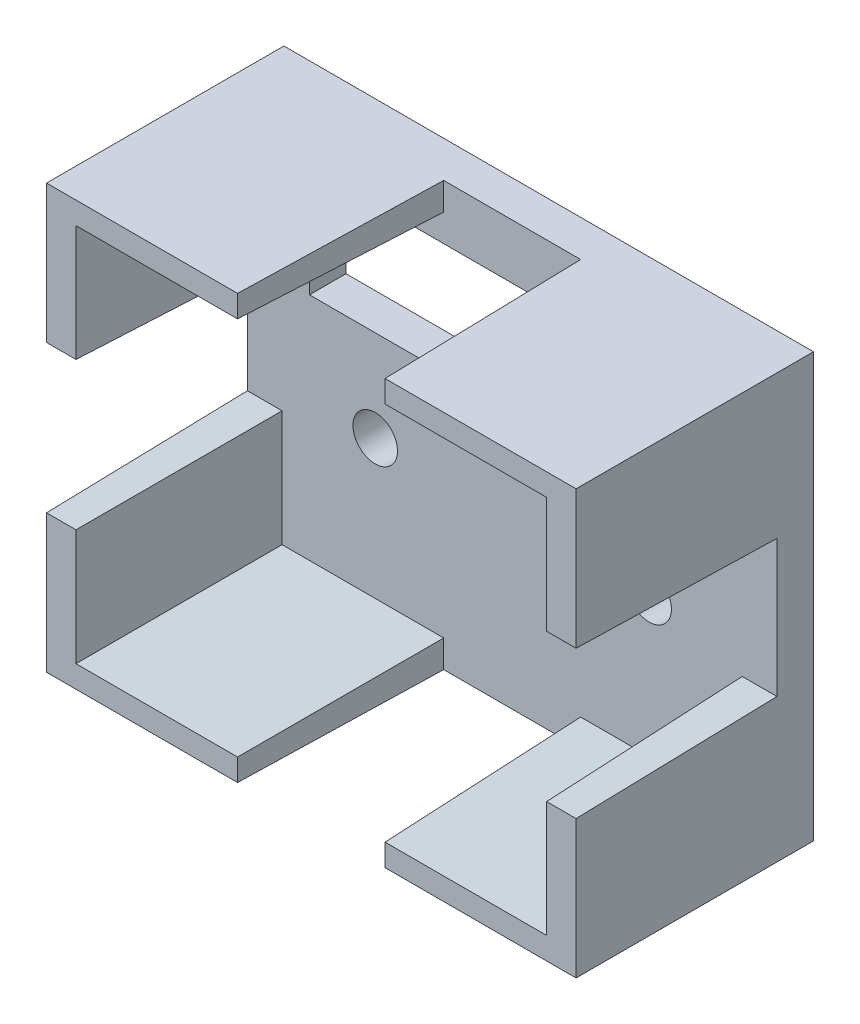
ISO-10303-21;
HEADER;
FILE_DESCRIPTION(('STEP AP214'),'2;1');
FILE_NAME('part.step','',(''),(''),'','','');
FILE_SCHEMA(('AUTOMOTIVE_DESIGN { 1 0 10303 214 1 1 1 1 }'));
ENDSEC;
DATA;
#1=APPLICATION_CONTEXT('core data for automotive mechanical design processes');
#2=APPLICATION_PROTOCOL_DEFINITION('international standard','automotive_design',2000,#1);
#3=PRODUCT_CONTEXT('',#1,'mechanical');
#4=PRODUCT('Part','Part','',(#3));
#5=PRODUCT_RELATED_PRODUCT_CATEGORY('part','',(#4));
#6=PRODUCT_DEFINITION_FORMATION('','',#4);
#7=PRODUCT_DEFINITION_CONTEXT('part definition',#1,'design');
#8=PRODUCT_DEFINITION('design','',#6,#7);
#9=PRODUCT_DEFINITION_SHAPE('','',#8);
#10=(LENGTH_UNIT() NAMED_UNIT(*) SI_UNIT(.MILLI.,.METRE.));
#11=(NAMED_UNIT(*) PLANE_ANGLE_UNIT() SI_UNIT($,.RADIAN.));
#12=(NAMED_UNIT(*) SI_UNIT($,.STERADIAN.) SOLID_ANGLE_UNIT());
#13=UNCERTAINTY_MEASURE_WITH_UNIT(LENGTH_MEASURE(1.E-05),#10,'distance_accuracy_value','');
#14=(GEOMETRIC_REPRESENTATION_CONTEXT(3) GLOBAL_UNCERTAINTY_ASSIGNED_CONTEXT((#13)) GLOBAL_UNIT_ASSIGNED_CONTEXT((#10,
#11,#12)) REPRESENTATION_CONTEXT('',''));
#15=CARTESIAN_POINT('',(0.,0.,0.));
#16=DIRECTION('',(0.,0.,1.));
#17=DIRECTION('',(1.,0.,0.));
#18=AXIS2_PLACEMENT_3D('',#15,#16,#17);
#19=CARTESIAN_POINT('',(0.,10.922,16.51));
#20=DIRECTION('',(0.,1.,0.));
#21=DIRECTION('',(0.,0.,1.));
#22=AXIS2_PLACEMENT_3D('',#19,#20,#21);
#23=PLANE('',#22);
#24=DIRECTION('',(1.,0.,0.));
#25=VECTOR('',#24,1.);
#26=CARTESIAN_POINT('',(400000.,10.9219999999937,2.54));
#27=LINE('',#26,#25);
#28=CARTESIAN_POINT('',(-14.0969999999925,10.9219999999937,2.54));
#29=VERTEX_POINT('',#28);
#30=CARTESIAN_POINT('',(14.0969999999925,10.9219999999937,2.54));
#31=VERTEX_POINT('',#30);
#32=EDGE_CURVE('E425',#29,#31,#27,.T.);
#33=ORIENTED_EDGE('',*,*,#32,.F.);
#34=DIRECTION('',(0.,0.,-1.));
#35=VECTOR('',#34,1.);
#36=CARTESIAN_POINT('',(-14.097,10.922,16.51));
#37=LINE('',#36,#35);
#38=CARTESIAN_POINT('',(-14.097,10.922,0.));
#39=VERTEX_POINT('',#38);
#40=EDGE_CURVE('E452',#29,#39,#37,.T.);
#41=ORIENTED_EDGE('',*,*,#40,.T.);
#42=DIRECTION('',(1.,0.,0.));
#43=VECTOR('',#42,1.);
#44=CARTESIAN_POINT('',(0.,10.922,0.));
#45=LINE('',#44,#43);
#46=CARTESIAN_POINT('',(14.097,10.922,0.));
#47=VERTEX_POINT('',#46);
#48=EDGE_CURVE('E532',#39,#47,#45,.T.);
#49=ORIENTED_EDGE('',*,*,#48,.T.);
#50=DIRECTION('',(0.,0.,-1.));
#51=VECTOR('',#50,1.);
#52=CARTESIAN_POINT('',(14.097,10.922,16.51));
#53=LINE('',#52,#51);
#54=EDGE_CURVE('E446',#31,#47,#53,.T.);
#55=ORIENTED_EDGE('',*,*,#54,.F.);
#56=EDGE_LOOP('',(#33,#41,#49,#55));
#57=FACE_BOUND('',#56,.T.);
#58=ADVANCED_FACE('F239',(#57),#23,.F.);
#59=CARTESIAN_POINT('',(14.097,0.,16.51));
#60=DIRECTION('',(1.,0.,0.));
#61=DIRECTION('',(0.,0.,-1.));
#62=AXIS2_PLACEMENT_3D('',#59,#60,#61);
#63=PLANE('',#62);
#64=DIRECTION('',(0.,-1.,0.));
#65=VECTOR('',#64,1.);
#66=CARTESIAN_POINT('',(14.0969999999925,-291583.236,2.54));
#67=LINE('',#66,#65);
#68=CARTESIAN_POINT('',(14.0969999999925,3.17499999999882,2.54));
#69=VERTEX_POINT('',#68);
#70=EDGE_CURVE('E422',#31,#69,#67,.T.);
#71=ORIENTED_EDGE('',*,*,#70,.F.);
#72=ORIENTED_EDGE('',*,*,#54,.T.);
#73=DIRECTION('',(0.,-1.,0.));
#74=VECTOR('',#73,1.);
#75=CARTESIAN_POINT('',(14.097,0.,0.));
#76=LINE('',#75,#74);
#77=CARTESIAN_POINT('',(14.097,3.17500000000001,0.));
#78=VERTEX_POINT('',#77);
#79=EDGE_CURVE('E443',#47,#78,#76,.T.);
#80=ORIENTED_EDGE('',*,*,#79,.T.);
#81=DIRECTION('',(0.,0.,-1.));
#82=VECTOR('',#81,1.);
#83=CARTESIAN_POINT('',(14.097,3.17500000000001,16.51));
#84=LINE('',#83,#82);
#85=EDGE_CURVE('E435',#69,#78,#84,.T.);
#86=ORIENTED_EDGE('',*,*,#85,.F.);
#87=EDGE_LOOP('',(#71,#72,#80,#86));
#88=FACE_BOUND('',#87,.T.);
#89=ADVANCED_FACE('F441',(#88),#63,.F.);
#90=CARTESIAN_POINT('',(-18.415,0.,16.51));
#91=DIRECTION('',(1.,0.,0.));
#92=DIRECTION('',(0.,0.,-1.));
#93=AXIS2_PLACEMENT_3D('',#90,#91,#92);
#94=PLANE('',#93);
#95=DIRECTION('',(0.,0.0261769483078732,0.999657324975557));
#96=VECTOR('',#95,1.);
#97=CARTESIAN_POINT('',(-18.415,5.12480323401792,16.3758023044565));
#98=LINE('',#97,#96);
#99=CARTESIAN_POINT('',(-18.4150000000045,5.12831732434819,16.51));
#100=VERTEX_POINT('',#99);
#101=CARTESIAN_POINT('',(-18.4150000000045,4.76250000002665,2.54));
#102=VERTEX_POINT('',#101);
#103=EDGE_CURVE('E741',#100,#102,#98,.F.);
#104=ORIENTED_EDGE('',*,*,#103,.F.);
#105=DIRECTION('',(0.,-1.,0.));
#106=VECTOR('',#105,1.);
#107=CARTESIAN_POINT('',(-18.415,0.,16.51));
#108=LINE('',#107,#106);
#109=CARTESIAN_POINT('',(-18.415,14.732,16.51));
#110=VERTEX_POINT('',#109);
#111=EDGE_CURVE('E495',#110,#100,#108,.T.);
#112=ORIENTED_EDGE('',*,*,#111,.F.);
#113=DIRECTION('',(0.,0.,-1.));
#114=VECTOR('',#113,1.);
#115=CARTESIAN_POINT('',(-18.415,14.732,16.51));
#116=LINE('',#115,#114);
#117=CARTESIAN_POINT('',(-18.415,14.732,0.));
#118=VERTEX_POINT('',#117);
#119=EDGE_CURVE('E467',#110,#118,#116,.T.);
#120=ORIENTED_EDGE('',*,*,#119,.T.);
#121=DIRECTION('',(0.,-1.,0.));
#122=VECTOR('',#121,1.);
#123=CARTESIAN_POINT('',(-18.415,0.,0.));
#124=LINE('',#123,#122);
#125=CARTESIAN_POINT('',(-18.415,-14.732,0.));
#126=VERTEX_POINT('',#125);
#127=EDGE_CURVE('E513',#118,#126,#124,.T.);
#128=ORIENTED_EDGE('',*,*,#127,.T.);
#129=DIRECTION('',(0.,0.,-1.));
#130=VECTOR('',#129,1.);
#131=CARTESIAN_POINT('',(-18.415,-14.732,16.51));
#132=LINE('',#131,#130);
#133=CARTESIAN_POINT('',(-18.415,-14.732,16.51));
#134=VERTEX_POINT('',#133);
#135=EDGE_CURVE('E463',#134,#126,#132,.T.);
#136=ORIENTED_EDGE('',*,*,#135,.F.);
#137=CARTESIAN_POINT('',(-18.4150000000045,-5.12831732434819,16.51));
#138=VERTEX_POINT('',#137);
#139=EDGE_CURVE('E502',#138,#134,#108,.T.);
#140=ORIENTED_EDGE('',*,*,#139,.F.);
#141=DIRECTION('',(0.,0.0261769483078732,-0.999657324975557));
#142=VECTOR('',#141,1.);
#143=CARTESIAN_POINT('',(-18.415,-5.12480323401792,16.3758023044565));
#144=LINE('',#143,#142);
#145=CARTESIAN_POINT('',(-18.4150000000045,-4.76250000002665,2.54));
#146=VERTEX_POINT('',#145);
#147=EDGE_CURVE('E737',#138,#146,#144,.T.);
#148=ORIENTED_EDGE('',*,*,#147,.T.);
#149=DIRECTION('',(0.,-1.,0.));
#150=VECTOR('',#149,1.);
#151=CARTESIAN_POINT('',(-18.4150000000045,-291583.236,2.54));
#152=LINE('',#151,#150);
#153=EDGE_CURVE('E622',#102,#146,#152,.T.);
#154=ORIENTED_EDGE('',*,*,#153,.F.);
#155=EDGE_LOOP('',(#104,#112,#120,#128,#136,#140,#148,#154));
#156=FACE_BOUND('',#155,.T.);
#157=ADVANCED_FACE('F800',(#156),#94,.F.);
#158=CARTESIAN_POINT('',(-9.525,-3.17499999999999,16.51));
#159=DIRECTION('',(0.,0.,-1.));
#160=DIRECTION('',(-1.,0.,0.));
#161=AXIS2_PLACEMENT_3D('',#158,#159,#160);
#162=CYLINDRICAL_SURFACE('',#161,1.55);
#163=CARTESIAN_POINT('',(-9.525,-3.17499999999999,0.));
#164=DIRECTION('',(0.,0.,1.));
#165=DIRECTION('',(1.,0.,0.));
#166=AXIS2_PLACEMENT_3D('',#163,#164,#165);
#167=CIRCLE('',#166,1.55);
#168=CARTESIAN_POINT('',(-7.975,-3.17499999999999,0.));
#169=VERTEX_POINT('',#168);
#170=EDGE_CURVE('E528',#169,#169,#167,.T.);
#171=ORIENTED_EDGE('',*,*,#170,.F.);
#172=EDGE_LOOP('',(#171));
#173=FACE_BOUND('',#172,.T.);
#174=CARTESIAN_POINT('',(-9.525,-3.17499999999999,2.54));
#175=DIRECTION('',(0.,0.,-1.));
#176=DIRECTION('',(-1.,0.,0.));
#177=AXIS2_PLACEMENT_3D('',#174,#175,#176);
#178=CIRCLE('',#177,1.55);
#179=CARTESIAN_POINT('',(-11.075,-3.17499999999999,2.54));
#180=VERTEX_POINT('',#179);
#181=EDGE_CURVE('E555',#180,#180,#178,.T.);
#182=ORIENTED_EDGE('',*,*,#181,.F.);
#183=EDGE_LOOP('',(#182));
#184=FACE_BOUND('',#183,.T.);
#185=ADVANCED_FACE('F833',(#173,#184),#162,.F.);
#186=CARTESIAN_POINT('',(9.525,-3.17499999999999,16.51));
#187=DIRECTION('',(0.,0.,-1.));
#188=DIRECTION('',(-1.,0.,0.));
#189=AXIS2_PLACEMENT_3D('',#186,#187,#188);
#190=CYLINDRICAL_SURFACE('',#189,1.55);
#191=CARTESIAN_POINT('',(9.525,-3.17499999999999,0.));
#192=DIRECTION('',(0.,0.,1.));
#193=DIRECTION('',(1.,0.,0.));
#194=AXIS2_PLACEMENT_3D('',#191,#192,#193);
#195=CIRCLE('',#194,1.55);
#196=CARTESIAN_POINT('',(11.075,-3.17499999999999,0.));
#197=VERTEX_POINT('',#196);
#198=EDGE_CURVE('E524',#197,#197,#195,.T.);
#199=ORIENTED_EDGE('',*,*,#198,.F.);
#200=EDGE_LOOP('',(#199));
#201=FACE_BOUND('',#200,.T.);
#202=CARTESIAN_POINT('',(9.525,-3.17499999999999,2.54));
#203=DIRECTION('',(0.,0.,-1.));
#204=DIRECTION('',(-1.,0.,0.));
#205=AXIS2_PLACEMENT_3D('',#202,#203,#204);
#206=CIRCLE('',#205,1.55);
#207=CARTESIAN_POINT('',(7.975,-3.17499999999999,2.54));
#208=VERTEX_POINT('',#207);
#209=EDGE_CURVE('E559',#208,#208,#206,.T.);
#210=ORIENTED_EDGE('',*,*,#209,.F.);
#211=EDGE_LOOP('',(#210));
#212=FACE_BOUND('',#211,.T.);
#213=ADVANCED_FACE('F836',(#201,#212),#190,.F.);
#214=CARTESIAN_POINT('',(18.415,0.,16.51));
#215=DIRECTION('',(1.,0.,0.));
#216=DIRECTION('',(0.,0.,-1.));
#217=AXIS2_PLACEMENT_3D('',#214,#215,#216);
#218=PLANE('',#217);
#219=DIRECTION('',(0.,-1.,0.));
#220=VECTOR('',#219,1.);
#221=CARTESIAN_POINT('',(18.4150000000045,-291583.236,2.54));
#222=LINE('',#221,#220);
#223=CARTESIAN_POINT('',(18.4150000000045,4.76250000002665,2.54));
#224=VERTEX_POINT('',#223);
#225=CARTESIAN_POINT('',(18.4150000000045,-4.76250000002665,2.54));
#226=VERTEX_POINT('',#225);
#227=EDGE_CURVE('E585',#224,#226,#222,.T.);
#228=ORIENTED_EDGE('',*,*,#227,.T.);
#229=DIRECTION('',(0.,0.0261769483078732,-0.999657324975557));
#230=VECTOR('',#229,1.);
#231=CARTESIAN_POINT('',(18.415,-5.12480323401792,16.3758023044565));
#232=LINE('',#231,#230);
#233=CARTESIAN_POINT('',(18.4150000000045,-5.12831732434819,16.51));
#234=VERTEX_POINT('',#233);
#235=EDGE_CURVE('E727',#226,#234,#232,.F.);
#236=ORIENTED_EDGE('',*,*,#235,.T.);
#237=DIRECTION('',(0.,-1.,0.));
#238=VECTOR('',#237,1.);
#239=CARTESIAN_POINT('',(18.415,0.,16.51));
#240=LINE('',#239,#238);
#241=CARTESIAN_POINT('',(18.415,-14.732,16.51));
#242=VERTEX_POINT('',#241);
#243=EDGE_CURVE('E500',#234,#242,#240,.T.);
#244=ORIENTED_EDGE('',*,*,#243,.T.);
#245=DIRECTION('',(0.,0.,-1.));
#246=VECTOR('',#245,1.);
#247=CARTESIAN_POINT('',(18.415,-14.732,16.51));
#248=LINE('',#247,#246);
#249=CARTESIAN_POINT('',(18.415,-14.732,0.));
#250=VERTEX_POINT('',#249);
#251=EDGE_CURVE('E459',#242,#250,#248,.T.);
#252=ORIENTED_EDGE('',*,*,#251,.T.);
#253=DIRECTION('',(0.,-1.,0.));
#254=VECTOR('',#253,1.);
#255=CARTESIAN_POINT('',(18.415,0.,0.));
#256=LINE('',#255,#254);
#257=CARTESIAN_POINT('',(18.415,14.732,0.));
#258=VERTEX_POINT('',#257);
#259=EDGE_CURVE('E520',#258,#250,#256,.T.);
#260=ORIENTED_EDGE('',*,*,#259,.F.);
#261=DIRECTION('',(0.,0.,-1.));
#262=VECTOR('',#261,1.);
#263=CARTESIAN_POINT('',(18.415,14.732,16.51));
#264=LINE('',#263,#262);
#265=CARTESIAN_POINT('',(18.415,14.732,16.51));
#266=VERTEX_POINT('',#265);
#267=EDGE_CURVE('E456',#266,#258,#264,.T.);
#268=ORIENTED_EDGE('',*,*,#267,.F.);
#269=CARTESIAN_POINT('',(18.4150000000045,5.12831732434819,16.51));
#270=VERTEX_POINT('',#269);
#271=EDGE_CURVE('E460',#266,#270,#240,.T.);
#272=ORIENTED_EDGE('',*,*,#271,.T.);
#273=DIRECTION('',(0.,0.0261769483078732,0.999657324975557));
#274=VECTOR('',#273,1.);
#275=CARTESIAN_POINT('',(18.415,5.12480323401792,16.3758023044565));
#276=LINE('',#275,#274);
#277=EDGE_CURVE('E723',#270,#224,#276,.F.);
#278=ORIENTED_EDGE('',*,*,#277,.T.);
#279=EDGE_LOOP('',(#228,#236,#244,#252,#260,#268,#272,#278));
#280=FACE_BOUND('',#279,.T.);
#281=ADVANCED_FACE('F761',(#280),#218,.T.);
#282=CARTESIAN_POINT('',(0.,0.,16.51));
#283=DIRECTION('',(0.,0.,1.));
#284=DIRECTION('',(1.,0.,0.));
#285=AXIS2_PLACEMENT_3D('',#282,#283,#284);
#286=PLANE('',#285);
#287=DIRECTION('',(0.,1.,0.));
#288=VECTOR('',#287,1.);
#289=CARTESIAN_POINT('',(-5.12831732434819,-291583.236,16.51));
#290=LINE('',#289,#288);
#291=CARTESIAN_POINT('',(-5.12831732434819,13.1928173243372,16.51));
#292=VERTEX_POINT('',#291);
#293=CARTESIAN_POINT('',(-5.12831732434819,14.7319999999809,16.51));
#294=VERTEX_POINT('',#293);
#295=EDGE_CURVE('E645',#292,#294,#290,.T.);
#296=ORIENTED_EDGE('',*,*,#295,.T.);
#297=DIRECTION('',(1.,0.,0.));
#298=VECTOR('',#297,1.);
#299=CARTESIAN_POINT('',(0.,14.732,16.51));
#300=LINE('',#299,#298);
#301=EDGE_CURVE('E745',#110,#294,#300,.T.);
#302=ORIENTED_EDGE('',*,*,#301,.F.);
#303=ORIENTED_EDGE('',*,*,#111,.T.);
#304=DIRECTION('',(1.,0.,0.));
#305=VECTOR('',#304,1.);
#306=CARTESIAN_POINT('',(400000.,5.12831732434819,16.51));
#307=LINE('',#306,#305);
#308=CARTESIAN_POINT('',(-16.367817324336,5.12831732434819,16.51));
#309=VERTEX_POINT('',#308);
#310=EDGE_CURVE('E691',#309,#100,#307,.F.);
#311=ORIENTED_EDGE('',*,*,#310,.F.);
#312=DIRECTION('',(0.,1.,0.));
#313=VECTOR('',#312,1.);
#314=CARTESIAN_POINT('',(-16.367817324336,-291583.236,16.51));
#315=LINE('',#314,#313);
#316=CARTESIAN_POINT('',(-16.367817324336,13.1928173243372,16.51));
#317=VERTEX_POINT('',#316);
#318=EDGE_CURVE('E688',#317,#309,#315,.F.);
#319=ORIENTED_EDGE('',*,*,#318,.F.);
#320=DIRECTION('',(1.,0.,0.));
#321=VECTOR('',#320,1.);
#322=CARTESIAN_POINT('',(400000.,13.1928173243372,16.51));
#323=LINE('',#322,#321);
#324=EDGE_CURVE('E684',#317,#292,#323,.T.);
#325=ORIENTED_EDGE('',*,*,#324,.T.);
#326=EDGE_LOOP('',(#296,#302,#303,#311,#319,#325));
#327=FACE_BOUND('',#326,.T.);
#328=ADVANCED_FACE('F782',(#327),#286,.T.);
#329=DIRECTION('',(-1.,0.,0.));
#330=VECTOR('',#329,1.);
#331=CARTESIAN_POINT('',(400000.,-13.1928173243372,16.51));
#332=LINE('',#331,#330);
#333=CARTESIAN_POINT('',(5.12831732434819,-13.1928173243372,16.51));
#334=VERTEX_POINT('',#333);
#335=CARTESIAN_POINT('',(16.367817324336,-13.1928173243372,16.51));
#336=VERTEX_POINT('',#335);
#337=EDGE_CURVE('E483',#334,#336,#332,.F.);
#338=ORIENTED_EDGE('',*,*,#337,.F.);
#339=DIRECTION('',(0.,1.,0.));
#340=VECTOR('',#339,1.);
#341=CARTESIAN_POINT('',(5.12831732434819,0.,16.51));
#342=LINE('',#341,#340);
#343=CARTESIAN_POINT('',(5.12831732434819,-14.7319999999809,16.51));
#344=VERTEX_POINT('',#343);
#345=EDGE_CURVE('E248',#334,#344,#342,.F.);
#346=ORIENTED_EDGE('',*,*,#345,.T.);
#347=DIRECTION('',(1.,0.,0.));
#348=VECTOR('',#347,1.);
#349=CARTESIAN_POINT('',(0.,-14.732,16.51));
#350=LINE('',#349,#348);
#351=EDGE_CURVE('E480',#344,#242,#350,.T.);
#352=ORIENTED_EDGE('',*,*,#351,.T.);
#353=ORIENTED_EDGE('',*,*,#243,.F.);
#354=DIRECTION('',(-1.,0.,0.));
#355=VECTOR('',#354,1.);
#356=CARTESIAN_POINT('',(400000.,-5.12831732434819,16.51));
#357=LINE('',#356,#355);
#358=CARTESIAN_POINT('',(16.367817324336,-5.12831732434819,16.51));
#359=VERTEX_POINT('',#358);
#360=EDGE_CURVE('E709',#359,#234,#357,.F.);
#361=ORIENTED_EDGE('',*,*,#360,.F.);
#362=DIRECTION('',(0.,-1.,0.));
#363=VECTOR('',#362,1.);
#364=CARTESIAN_POINT('',(16.367817324336,-291583.236,16.51));
#365=LINE('',#364,#363);
#366=EDGE_CURVE('E706',#359,#336,#365,.T.);
#367=ORIENTED_EDGE('',*,*,#366,.T.);
#368=EDGE_LOOP('',(#338,#346,#352,#353,#361,#367));
#369=FACE_BOUND('',#368,.T.);
#370=ADVANCED_FACE('F478',(#369),#286,.T.);
#371=DIRECTION('',(0.,-1.,0.));
#372=VECTOR('',#371,1.);
#373=CARTESIAN_POINT('',(16.367817324336,-291583.236,16.51));
#374=LINE('',#373,#372);
#375=CARTESIAN_POINT('',(16.367817324336,13.1928173243372,16.51));
#376=VERTEX_POINT('',#375);
#377=CARTESIAN_POINT('',(16.367817324336,5.12831732434819,16.51));
#378=VERTEX_POINT('',#377);
#379=EDGE_CURVE('E712',#376,#378,#374,.T.);
#380=ORIENTED_EDGE('',*,*,#379,.T.);
#381=DIRECTION('',(-1.,0.,0.));
#382=VECTOR('',#381,1.);
#383=CARTESIAN_POINT('',(0.,5.12831732434819,16.51));
#384=LINE('',#383,#382);
#385=EDGE_CURVE('E450',#378,#270,#384,.F.);
#386=ORIENTED_EDGE('',*,*,#385,.T.);
#387=ORIENTED_EDGE('',*,*,#271,.F.);
#388=CARTESIAN_POINT('',(5.12831732434819,14.7319999999809,16.51));
#389=VERTEX_POINT('',#388);
#390=EDGE_CURVE('E544',#389,#266,#300,.T.);
#391=ORIENTED_EDGE('',*,*,#390,.F.);
#392=DIRECTION('',(0.,-1.,0.));
#393=VECTOR('',#392,1.);
#394=CARTESIAN_POINT('',(5.12831732434819,-291583.236,16.51));
#395=LINE('',#394,#393);
#396=CARTESIAN_POINT('',(5.12831732434819,13.1928173243372,16.51));
#397=VERTEX_POINT('',#396);
#398=EDGE_CURVE('E640',#397,#389,#395,.F.);
#399=ORIENTED_EDGE('',*,*,#398,.F.);
#400=DIRECTION('',(1.,0.,0.));
#401=VECTOR('',#400,1.);
#402=CARTESIAN_POINT('',(400000.,13.1928173243372,16.51));
#403=LINE('',#402,#401);
#404=EDGE_CURVE('E263',#397,#376,#403,.T.);
#405=ORIENTED_EDGE('',*,*,#404,.T.);
#406=EDGE_LOOP('',(#380,#386,#387,#391,#399,#405));
#407=FACE_BOUND('',#406,.T.);
#408=ADVANCED_FACE('F762',(#407),#286,.T.);
#409=CARTESIAN_POINT('',(0.,3.17500000000001,16.51));
#410=DIRECTION('',(0.,1.,0.));
#411=DIRECTION('',(0.,0.,1.));
#412=AXIS2_PLACEMENT_3D('',#409,#410,#411);
#413=PLANE('',#412);
#414=DIRECTION('',(1.,0.,0.));
#415=VECTOR('',#414,1.);
#416=CARTESIAN_POINT('',(400000.,3.17499999999882,2.54));
#417=LINE('',#416,#415);
#418=CARTESIAN_POINT('',(-14.097,3.17500000000001,2.54000000004549));
#419=VERTEX_POINT('',#418);
#420=EDGE_CURVE('E255',#419,#69,#417,.T.);
#421=ORIENTED_EDGE('',*,*,#420,.T.);
#422=ORIENTED_EDGE('',*,*,#85,.T.);
#423=DIRECTION('',(1.,0.,0.));
#424=VECTOR('',#423,1.);
#425=CARTESIAN_POINT('',(0.,3.17500000000001,0.));
#426=LINE('',#425,#424);
#427=CARTESIAN_POINT('',(-14.097,3.17500000000001,0.));
#428=VERTEX_POINT('',#427);
#429=EDGE_CURVE('E538',#428,#78,#426,.T.);
#430=ORIENTED_EDGE('',*,*,#429,.F.);
#431=DIRECTION('',(0.,0.,-1.));
#432=VECTOR('',#431,1.);
#433=CARTESIAN_POINT('',(-14.097,3.17500000000001,16.51));
#434=LINE('',#433,#432);
#435=EDGE_CURVE('E437',#419,#428,#434,.T.);
#436=ORIENTED_EDGE('',*,*,#435,.F.);
#437=EDGE_LOOP('',(#421,#422,#430,#436));
#438=FACE_BOUND('',#437,.T.);
#439=ADVANCED_FACE('F433',(#438),#413,.T.);
#440=CARTESIAN_POINT('',(0.,14.732,16.51));
#441=DIRECTION('',(0.,1.,0.));
#442=DIRECTION('',(0.,0.,1.));
#443=AXIS2_PLACEMENT_3D('',#440,#441,#442);
#444=PLANE('',#443);
#445=DIRECTION('',(-0.0261769483078732,0.,0.999657324975557));
#446=VECTOR('',#445,1.);
#447=CARTESIAN_POINT('',(-5.12480323401792,14.732,16.3758023044565));
#448=LINE('',#447,#446);
#449=CARTESIAN_POINT('',(-4.76250000002665,14.7319999999809,2.54));
#450=VERTEX_POINT('',#449);
#451=EDGE_CURVE('E514',#450,#294,#448,.T.);
#452=ORIENTED_EDGE('',*,*,#451,.F.);
#453=DIRECTION('',(1.,0.,0.));
#454=VECTOR('',#453,1.);
#455=CARTESIAN_POINT('',(400000.,14.7319999999809,2.54));
#456=LINE('',#455,#454);
#457=CARTESIAN_POINT('',(4.76250000002665,14.7319999999809,2.54));
#458=VERTEX_POINT('',#457);
#459=EDGE_CURVE('E565',#450,#458,#456,.T.);
#460=ORIENTED_EDGE('',*,*,#459,.T.);
#461=DIRECTION('',(-0.0261769483078732,0.,-0.999657324975557));
#462=VECTOR('',#461,1.);
#463=CARTESIAN_POINT('',(5.12480323401792,14.732,16.3758023044565));
#464=LINE('',#463,#462);
#465=EDGE_CURVE('E680',#458,#389,#464,.F.);
#466=ORIENTED_EDGE('',*,*,#465,.T.);
#467=ORIENTED_EDGE('',*,*,#390,.T.);
#468=ORIENTED_EDGE('',*,*,#267,.T.);
#469=DIRECTION('',(1.,0.,0.));
#470=VECTOR('',#469,1.);
#471=CARTESIAN_POINT('',(0.,14.732,0.));
#472=LINE('',#471,#470);
#473=EDGE_CURVE('E509',#118,#258,#472,.T.);
#474=ORIENTED_EDGE('',*,*,#473,.F.);
#475=ORIENTED_EDGE('',*,*,#119,.F.);
#476=ORIENTED_EDGE('',*,*,#301,.T.);
#477=EDGE_LOOP('',(#452,#460,#466,#467,#468,#474,#475,#476));
#478=FACE_BOUND('',#477,.T.);
#479=ADVANCED_FACE('F241',(#478),#444,.T.);
#480=CARTESIAN_POINT('',(0.,-14.732,16.51));
#481=DIRECTION('',(0.,1.,0.));
#482=DIRECTION('',(0.,0.,1.));
#483=AXIS2_PLACEMENT_3D('',#480,#481,#482);
#484=PLANE('',#483);
#485=DIRECTION('',(1.,0.,0.));
#486=VECTOR('',#485,1.);
#487=CARTESIAN_POINT('',(400000.,-14.7319999999809,2.54));
#488=LINE('',#487,#486);
#489=CARTESIAN_POINT('',(-4.76250000002665,-14.7319999999809,2.54));
#490=VERTEX_POINT('',#489);
#491=CARTESIAN_POINT('',(4.76250000002665,-14.7319999999809,2.54));
#492=VERTEX_POINT('',#491);
#493=EDGE_CURVE('E604',#490,#492,#488,.T.);
#494=ORIENTED_EDGE('',*,*,#493,.F.);
#495=DIRECTION('',(-0.0261769483078732,0.,0.999657324975557));
#496=VECTOR('',#495,1.);
#497=CARTESIAN_POINT('',(-5.12480323401792,-14.732,16.3758023044565));
#498=LINE('',#497,#496);
#499=CARTESIAN_POINT('',(-5.12831732434819,-14.7319999999809,16.51));
#500=VERTEX_POINT('',#499);
#501=EDGE_CURVE('E733',#490,#500,#498,.T.);
#502=ORIENTED_EDGE('',*,*,#501,.T.);
#503=EDGE_CURVE('E494',#134,#500,#350,.T.);
#504=ORIENTED_EDGE('',*,*,#503,.F.);
#505=ORIENTED_EDGE('',*,*,#135,.T.);
#506=DIRECTION('',(1.,0.,0.));
#507=VECTOR('',#506,1.);
#508=CARTESIAN_POINT('',(0.,-14.732,0.));
#509=LINE('',#508,#507);
#510=EDGE_CURVE('E517',#126,#250,#509,.T.);
#511=ORIENTED_EDGE('',*,*,#510,.T.);
#512=ORIENTED_EDGE('',*,*,#251,.F.);
#513=ORIENTED_EDGE('',*,*,#351,.F.);
#514=DIRECTION('',(-0.0261769483078732,0.,-0.999657324975557));
#515=VECTOR('',#514,1.);
#516=CARTESIAN_POINT('',(5.12480323401792,-14.732,16.3758023044565));
#517=LINE('',#516,#515);
#518=EDGE_CURVE('E491',#492,#344,#517,.F.);
#519=ORIENTED_EDGE('',*,*,#518,.F.);
#520=EDGE_LOOP('',(#494,#502,#504,#505,#511,#512,#513,#519));
#521=FACE_BOUND('',#520,.T.);
#522=ADVANCED_FACE('F490',(#521),#484,.F.);
#523=CARTESIAN_POINT('',(-14.097,0.,16.51));
#524=DIRECTION('',(1.,0.,0.));
#525=DIRECTION('',(0.,0.,-1.));
#526=AXIS2_PLACEMENT_3D('',#523,#524,#525);
#527=PLANE('',#526);
#528=DIRECTION('',(0.,-1.,0.));
#529=VECTOR('',#528,1.);
#530=CARTESIAN_POINT('',(-14.0969999999925,-291583.236,2.54));
#531=LINE('',#530,#529);
#532=EDGE_CURVE('E439',#29,#419,#531,.T.);
#533=ORIENTED_EDGE('',*,*,#532,.T.);
#534=ORIENTED_EDGE('',*,*,#435,.T.);
#535=DIRECTION('',(0.,-1.,0.));
#536=VECTOR('',#535,1.);
#537=CARTESIAN_POINT('',(-14.097,0.,0.));
#538=LINE('',#537,#536);
#539=EDGE_CURVE('E541',#39,#428,#538,.T.);
#540=ORIENTED_EDGE('',*,*,#539,.F.);
#541=ORIENTED_EDGE('',*,*,#40,.F.);
#542=EDGE_LOOP('',(#533,#534,#540,#541));
#543=FACE_BOUND('',#542,.T.);
#544=ADVANCED_FACE('F553',(#543),#527,.T.);
#545=DIRECTION('',(-1.,0.,0.));
#546=VECTOR('',#545,1.);
#547=CARTESIAN_POINT('',(400000.,-5.12831732434819,16.51));
#548=LINE('',#547,#546);
#549=CARTESIAN_POINT('',(-16.367817324336,-5.12831732434819,16.51));
#550=VERTEX_POINT('',#549);
#551=EDGE_CURVE('E694',#550,#138,#548,.T.);
#552=ORIENTED_EDGE('',*,*,#551,.T.);
#553=ORIENTED_EDGE('',*,*,#139,.T.);
#554=ORIENTED_EDGE('',*,*,#503,.T.);
#555=DIRECTION('',(0.,-1.,0.));
#556=VECTOR('',#555,1.);
#557=CARTESIAN_POINT('',(-5.12831732434819,0.,16.51));
#558=LINE('',#557,#556);
#559=CARTESIAN_POINT('',(-5.12831732434819,-13.1928173243372,16.51));
#560=VERTEX_POINT('',#559);
#561=EDGE_CURVE('E12',#560,#500,#558,.T.);
#562=ORIENTED_EDGE('',*,*,#561,.F.);
#563=DIRECTION('',(-1.,0.,0.));
#564=VECTOR('',#563,1.);
#565=CARTESIAN_POINT('',(400000.,-13.1928173243372,16.51));
#566=LINE('',#565,#564);
#567=CARTESIAN_POINT('',(-16.367817324336,-13.1928173243372,16.51));
#568=VERTEX_POINT('',#567);
#569=EDGE_CURVE('E701',#568,#560,#566,.F.);
#570=ORIENTED_EDGE('',*,*,#569,.F.);
#571=DIRECTION('',(0.,1.,0.));
#572=VECTOR('',#571,1.);
#573=CARTESIAN_POINT('',(-16.367817324336,-291583.236,16.51));
#574=LINE('',#573,#572);
#575=EDGE_CURVE('E698',#550,#568,#574,.F.);
#576=ORIENTED_EDGE('',*,*,#575,.F.);
#577=EDGE_LOOP('',(#552,#553,#554,#562,#570,#576));
#578=FACE_BOUND('',#577,.T.);
#579=ADVANCED_FACE('F820',(#578),#286,.T.);
#580=CARTESIAN_POINT('',(0.,0.,0.));
#581=DIRECTION('',(0.,0.,1.));
#582=DIRECTION('',(1.,0.,0.));
#583=AXIS2_PLACEMENT_3D('',#580,#581,#582);
#584=PLANE('',#583);
#585=ORIENTED_EDGE('',*,*,#473,.T.);
#586=ORIENTED_EDGE('',*,*,#259,.T.);
#587=ORIENTED_EDGE('',*,*,#510,.F.);
#588=ORIENTED_EDGE('',*,*,#127,.F.);
#589=EDGE_LOOP('',(#585,#586,#587,#588));
#590=FACE_BOUND('',#589,.T.);
#591=ORIENTED_EDGE('',*,*,#198,.T.);
#592=EDGE_LOOP('',(#591));
#593=FACE_BOUND('',#592,.T.);
#594=ORIENTED_EDGE('',*,*,#170,.T.);
#595=EDGE_LOOP('',(#594));
#596=FACE_BOUND('',#595,.T.);
#597=ORIENTED_EDGE('',*,*,#48,.F.);
#598=ORIENTED_EDGE('',*,*,#539,.T.);
#599=ORIENTED_EDGE('',*,*,#429,.T.);
#600=ORIENTED_EDGE('',*,*,#79,.F.);
#601=EDGE_LOOP('',(#597,#598,#599,#600));
#602=FACE_BOUND('',#601,.T.);
#603=ADVANCED_FACE('F552',(#590,#593,#596,#602),#584,.F.);
#604=CARTESIAN_POINT('',(400000.,4.76250000002665,2.54));
#605=DIRECTION('',(0.,0.999657324975557,-0.0261769483078732));
#606=DIRECTION('',(0.,0.0261769483078732,0.999657324975557));
#607=AXIS2_PLACEMENT_3D('',#604,#605,#606);
#608=PLANE('',#607);
#609=ORIENTED_EDGE('',*,*,#103,.T.);
#610=DIRECTION('',(-1.,0.,0.));
#611=VECTOR('',#610,1.);
#612=CARTESIAN_POINT('',(400000.,4.76250000002665,2.54));
#613=LINE('',#612,#611);
#614=CARTESIAN_POINT('',(-16.0020000000145,4.76250000002665,2.54));
#615=VERTEX_POINT('',#614);
#616=EDGE_CURVE('E625',#615,#102,#613,.T.);
#617=ORIENTED_EDGE('',*,*,#616,.F.);
#618=DIRECTION('',(0.0261679842649794,-0.0261679842649794,-0.99931500198837));
#619=VECTOR('',#618,1.);
#620=CARTESIAN_POINT('',(183.666789395563,-194.906289395533,-7622.50343671936));
#621=LINE('',#620,#619);
#622=EDGE_CURVE('E670',#309,#615,#621,.T.);
#623=ORIENTED_EDGE('',*,*,#622,.F.);
#624=ORIENTED_EDGE('',*,*,#310,.T.);
#625=EDGE_LOOP('',(#609,#617,#623,#624));
#626=FACE_BOUND('',#625,.T.);
#627=ADVANCED_FACE('F796',(#626),#608,.F.);
#628=CARTESIAN_POINT('',(400000.,-4.76250000002665,2.54));
#629=DIRECTION('',(0.,-0.999657324975557,-0.0261769483078732));
#630=DIRECTION('',(0.,0.0261769483078732,-0.999657324975557));
#631=AXIS2_PLACEMENT_3D('',#628,#629,#630);
#632=PLANE('',#631);
#633=ORIENTED_EDGE('',*,*,#551,.F.);
#634=DIRECTION('',(-0.0261679842649794,-0.0261679842649794,0.99931500198837));
#635=VECTOR('',#634,1.);
#636=CARTESIAN_POINT('',(-215.664267024202,-204.42476702425,7627.33435740502));
#637=LINE('',#636,#635);
#638=CARTESIAN_POINT('',(-16.0020000000145,-4.76250000002665,2.54));
#639=VERTEX_POINT('',#638);
#640=EDGE_CURVE('E667',#550,#639,#637,.F.);
#641=ORIENTED_EDGE('',*,*,#640,.T.);
#642=DIRECTION('',(-1.,0.,0.));
#643=VECTOR('',#642,1.);
#644=CARTESIAN_POINT('',(400000.,-4.76250000002665,2.54));
#645=LINE('',#644,#643);
#646=EDGE_CURVE('E618',#639,#146,#645,.T.);
#647=ORIENTED_EDGE('',*,*,#646,.T.);
#648=ORIENTED_EDGE('',*,*,#147,.F.);
#649=EDGE_LOOP('',(#633,#641,#647,#648));
#650=FACE_BOUND('',#649,.T.);
#651=ADVANCED_FACE('F805',(#650),#632,.F.);
#652=CARTESIAN_POINT('',(-4.76250000002665,-291583.236,2.54));
#653=DIRECTION('',(-0.999657324975557,0.,-0.0261769483078732));
#654=DIRECTION('',(-0.0261769483078732,0.,0.999657324975557));
#655=AXIS2_PLACEMENT_3D('',#652,#653,#654);
#656=PLANE('',#655);
#657=DIRECTION('',(0.,1.,0.));
#658=VECTOR('',#657,1.);
#659=CARTESIAN_POINT('',(-4.76250000002665,-291583.236,2.54));
#660=LINE('',#659,#658);
#661=CARTESIAN_POINT('',(-4.76250000002665,-12.8270000000157,2.54));
#662=VERTEX_POINT('',#661);
#663=EDGE_CURVE('E607',#490,#662,#660,.T.);
#664=ORIENTED_EDGE('',*,*,#663,.T.);
#665=DIRECTION('',(-0.0261679842649794,-0.0261679842649794,0.99931500198837));
#666=VECTOR('',#665,1.);
#667=CARTESIAN_POINT('',(-204.419244749771,-212.483744749761,7627.12347025222));
#668=LINE('',#667,#666);
#669=EDGE_CURVE('E660',#560,#662,#668,.F.);
#670=ORIENTED_EDGE('',*,*,#669,.F.);
#671=ORIENTED_EDGE('',*,*,#561,.T.);
#672=ORIENTED_EDGE('',*,*,#501,.F.);
#673=EDGE_LOOP('',(#664,#670,#671,#672));
#674=FACE_BOUND('',#673,.T.);
#675=ADVANCED_FACE('F816',(#674),#656,.F.);
#676=CARTESIAN_POINT('',(4.76250000002665,-291583.236,2.54));
#677=DIRECTION('',(0.999657324975557,0.,-0.0261769483078732));
#678=DIRECTION('',(-0.0261769483078732,0.,-0.999657324975557));
#679=AXIS2_PLACEMENT_3D('',#676,#677,#678);
#680=PLANE('',#679);
#681=ORIENTED_EDGE('',*,*,#518,.T.);
#682=ORIENTED_EDGE('',*,*,#345,.F.);
#683=DIRECTION('',(-0.0261679842649794,0.0261679842649794,-0.99931500198837));
#684=VECTOR('',#683,1.);
#685=CARTESIAN_POINT('',(204.419244749771,-212.483744749761,7627.12347025222));
#686=LINE('',#685,#684);
#687=CARTESIAN_POINT('',(4.76250000002665,-12.8270000000157,2.54));
#688=VERTEX_POINT('',#687);
#689=EDGE_CURVE('E657',#334,#688,#686,.T.);
#690=ORIENTED_EDGE('',*,*,#689,.T.);
#691=DIRECTION('',(0.,1.,0.));
#692=VECTOR('',#691,1.);
#693=CARTESIAN_POINT('',(4.76250000002665,-291583.236,2.54));
#694=LINE('',#693,#692);
#695=EDGE_CURVE('E601',#492,#688,#694,.T.);
#696=ORIENTED_EDGE('',*,*,#695,.F.);
#697=EDGE_LOOP('',(#681,#682,#690,#696));
#698=FACE_BOUND('',#697,.T.);
#699=ADVANCED_FACE('F841',(#698),#680,.F.);
#700=CARTESIAN_POINT('',(0.,0.,2.54));
#701=DIRECTION('',(0.,0.,1.));
#702=DIRECTION('',(1.,0.,0.));
#703=AXIS2_PLACEMENT_3D('',#700,#701,#702);
#704=PLANE('',#703);
#705=ORIENTED_EDGE('',*,*,#209,.T.);
#706=EDGE_LOOP('',(#705));
#707=FACE_BOUND('',#706,.T.);
#708=ORIENTED_EDGE('',*,*,#181,.T.);
#709=EDGE_LOOP('',(#708));
#710=FACE_BOUND('',#709,.T.);
#711=ORIENTED_EDGE('',*,*,#459,.F.);
#712=DIRECTION('',(0.,1.,0.));
#713=VECTOR('',#712,1.);
#714=CARTESIAN_POINT('',(-4.76250000002665,-291583.236,2.54));
#715=LINE('',#714,#713);
#716=CARTESIAN_POINT('',(-4.76250000002665,12.8270000000157,2.54));
#717=VERTEX_POINT('',#716);
#718=EDGE_CURVE('E636',#717,#450,#715,.T.);
#719=ORIENTED_EDGE('',*,*,#718,.F.);
#720=DIRECTION('',(1.,0.,0.));
#721=VECTOR('',#720,1.);
#722=CARTESIAN_POINT('',(400000.,12.8270000000157,2.54));
#723=LINE('',#722,#721);
#724=CARTESIAN_POINT('',(-16.0020000000145,12.8270000000157,2.54));
#725=VERTEX_POINT('',#724);
#726=EDGE_CURVE('E632',#725,#717,#723,.T.);
#727=ORIENTED_EDGE('',*,*,#726,.F.);
#728=DIRECTION('',(0.,-1.,0.));
#729=VECTOR('',#728,1.);
#730=CARTESIAN_POINT('',(-16.0020000000145,-291583.236,2.54));
#731=LINE('',#730,#729);
#732=EDGE_CURVE('E629',#725,#615,#731,.T.);
#733=ORIENTED_EDGE('',*,*,#732,.T.);
#734=ORIENTED_EDGE('',*,*,#616,.T.);
#735=ORIENTED_EDGE('',*,*,#153,.T.);
#736=ORIENTED_EDGE('',*,*,#646,.F.);
#737=DIRECTION('',(0.,-1.,0.));
#738=VECTOR('',#737,1.);
#739=CARTESIAN_POINT('',(-16.0020000000145,-291583.236,2.54));
#740=LINE('',#739,#738);
#741=CARTESIAN_POINT('',(-16.0020000000145,-12.8270000000157,2.54));
#742=VERTEX_POINT('',#741);
#743=EDGE_CURVE('E615',#639,#742,#740,.T.);
#744=ORIENTED_EDGE('',*,*,#743,.T.);
#745=DIRECTION('',(1.,0.,0.));
#746=VECTOR('',#745,1.);
#747=CARTESIAN_POINT('',(400000.,-12.8270000000157,2.54));
#748=LINE('',#747,#746);
#749=EDGE_CURVE('E611',#742,#662,#748,.T.);
#750=ORIENTED_EDGE('',*,*,#749,.T.);
#751=ORIENTED_EDGE('',*,*,#663,.F.);
#752=ORIENTED_EDGE('',*,*,#493,.T.);
#753=ORIENTED_EDGE('',*,*,#695,.T.);
#754=DIRECTION('',(1.,0.,0.));
#755=VECTOR('',#754,1.);
#756=CARTESIAN_POINT('',(400000.,-12.8270000000157,2.54));
#757=LINE('',#756,#755);
#758=CARTESIAN_POINT('',(16.0020000000145,-12.8270000000157,2.54));
#759=VERTEX_POINT('',#758);
#760=EDGE_CURVE('E597',#688,#759,#757,.T.);
#761=ORIENTED_EDGE('',*,*,#760,.T.);
#762=DIRECTION('',(0.,-1.,0.));
#763=VECTOR('',#762,1.);
#764=CARTESIAN_POINT('',(16.0020000000145,-291583.236,2.54));
#765=LINE('',#764,#763);
#766=CARTESIAN_POINT('',(16.0020000000145,-4.76250000002665,2.54));
#767=VERTEX_POINT('',#766);
#768=EDGE_CURVE('E593',#767,#759,#765,.T.);
#769=ORIENTED_EDGE('',*,*,#768,.F.);
#770=DIRECTION('',(1.,0.,0.));
#771=VECTOR('',#770,1.);
#772=CARTESIAN_POINT('',(400000.,-4.76250000002665,2.54));
#773=LINE('',#772,#771);
#774=EDGE_CURVE('E589',#767,#226,#773,.T.);
#775=ORIENTED_EDGE('',*,*,#774,.T.);
#776=ORIENTED_EDGE('',*,*,#227,.F.);
#777=DIRECTION('',(-1.,0.,0.));
#778=VECTOR('',#777,1.);
#779=CARTESIAN_POINT('',(400000.,4.76250000002665,2.54));
#780=LINE('',#779,#778);
#781=CARTESIAN_POINT('',(16.0020000000145,4.76250000002665,2.54));
#782=VERTEX_POINT('',#781);
#783=EDGE_CURVE('E581',#224,#782,#780,.T.);
#784=ORIENTED_EDGE('',*,*,#783,.T.);
#785=DIRECTION('',(0.,-1.,0.));
#786=VECTOR('',#785,1.);
#787=CARTESIAN_POINT('',(16.0020000000145,-291583.236,2.54));
#788=LINE('',#787,#786);
#789=CARTESIAN_POINT('',(16.0020000000145,12.8270000000157,2.54));
#790=VERTEX_POINT('',#789);
#791=EDGE_CURVE('E577',#790,#782,#788,.T.);
#792=ORIENTED_EDGE('',*,*,#791,.F.);
#793=DIRECTION('',(1.,0.,0.));
#794=VECTOR('',#793,1.);
#795=CARTESIAN_POINT('',(400000.,12.8270000000157,2.54));
#796=LINE('',#795,#794);
#797=CARTESIAN_POINT('',(4.76250000002665,12.8270000000157,2.54));
#798=VERTEX_POINT('',#797);
#799=EDGE_CURVE('E573',#798,#790,#796,.T.);
#800=ORIENTED_EDGE('',*,*,#799,.F.);
#801=DIRECTION('',(0.,1.,0.));
#802=VECTOR('',#801,1.);
#803=CARTESIAN_POINT('',(4.76250000002665,-291583.236,2.54));
#804=LINE('',#803,#802);
#805=EDGE_CURVE('E569',#798,#458,#804,.T.);
#806=ORIENTED_EDGE('',*,*,#805,.T.);
#807=EDGE_LOOP('',(#711,#719,#727,#733,#734,#735,#736,#744,#750,#751,#752,#753,#761,#769,#775,
#776,#784,#792,#800,#806));
#808=FACE_BOUND('',#807,.T.);
#809=ORIENTED_EDGE('',*,*,#532,.F.);
#810=ORIENTED_EDGE('',*,*,#32,.T.);
#811=ORIENTED_EDGE('',*,*,#70,.T.);
#812=ORIENTED_EDGE('',*,*,#420,.F.);
#813=EDGE_LOOP('',(#809,#810,#811,#812));
#814=FACE_BOUND('',#813,.T.);
#815=ADVANCED_FACE('F423',(#707,#710,#808,#814),#704,.T.);
#816=CARTESIAN_POINT('',(-4.76250000002665,-291583.236,2.54));
#817=DIRECTION('',(-0.999657324975557,0.,-0.0261769483078732));
#818=DIRECTION('',(-0.0261769483078732,0.,0.999657324975557));
#819=AXIS2_PLACEMENT_3D('',#816,#817,#818);
#820=PLANE('',#819);
#821=ORIENTED_EDGE('',*,*,#451,.T.);
#822=ORIENTED_EDGE('',*,*,#295,.F.);
#823=DIRECTION('',(0.0261679842649794,-0.0261679842649794,-0.99931500198837));
#824=VECTOR('',#823,1.);
#825=CARTESIAN_POINT('',(194.911811669994,-186.847311669965,-7622.71432387216));
#826=LINE('',#825,#824);
#827=EDGE_CURVE('E677',#292,#717,#826,.T.);
#828=ORIENTED_EDGE('',*,*,#827,.T.);
#829=ORIENTED_EDGE('',*,*,#718,.T.);
#830=EDGE_LOOP('',(#821,#822,#828,#829));
#831=FACE_BOUND('',#830,.T.);
#832=ADVANCED_FACE('F780',(#831),#820,.F.);
#833=CARTESIAN_POINT('',(400000.,12.8270000000157,2.54));
#834=DIRECTION('',(0.,0.999657324975557,-0.0261769483078732));
#835=DIRECTION('',(0.,0.0261769483078732,0.999657324975557));
#836=AXIS2_PLACEMENT_3D('',#833,#834,#835);
#837=PLANE('',#836);
#838=ORIENTED_EDGE('',*,*,#726,.T.);
#839=ORIENTED_EDGE('',*,*,#827,.F.);
#840=ORIENTED_EDGE('',*,*,#324,.F.);
#841=DIRECTION('',(-0.0261679842649794,0.0261679842649794,0.99931500198837));
#842=VECTOR('',#841,1.);
#843=CARTESIAN_POINT('',(257.914317780774,-261.089317780803,-10457.9021523639));
#844=LINE('',#843,#842);
#845=EDGE_CURVE('E674',#317,#725,#844,.F.);
#846=ORIENTED_EDGE('',*,*,#845,.T.);
#847=EDGE_LOOP('',(#838,#839,#840,#846));
#848=FACE_BOUND('',#847,.T.);
#849=ADVANCED_FACE('F787',(#848),#837,.F.);
#850=CARTESIAN_POINT('',(-16.0020000000145,-291583.236,2.54));
#851=DIRECTION('',(-0.999657324975557,0.,-0.0261769483078732));
#852=DIRECTION('',(-0.0261769483078732,0.,0.999657324975557));
#853=AXIS2_PLACEMENT_3D('',#850,#851,#852);
#854=PLANE('',#853);
#855=ORIENTED_EDGE('',*,*,#732,.F.);
#856=ORIENTED_EDGE('',*,*,#845,.F.);
#857=ORIENTED_EDGE('',*,*,#318,.T.);
#858=ORIENTED_EDGE('',*,*,#622,.T.);
#859=EDGE_LOOP('',(#855,#856,#857,#858));
#860=FACE_BOUND('',#859,.T.);
#861=ADVANCED_FACE('F794',(#860),#854,.F.);
#862=CARTESIAN_POINT('',(-16.0020000000145,-291583.236,2.54));
#863=DIRECTION('',(-0.999657324975557,0.,-0.0261769483078732));
#864=DIRECTION('',(-0.0261769483078732,0.,0.999657324975557));
#865=AXIS2_PLACEMENT_3D('',#862,#863,#864);
#866=PLANE('',#865);
#867=ORIENTED_EDGE('',*,*,#743,.F.);
#868=ORIENTED_EDGE('',*,*,#640,.F.);
#869=ORIENTED_EDGE('',*,*,#575,.T.);
#870=DIRECTION('',(0.0261679842649794,0.0261679842649794,-0.99931500198837));
#871=VECTOR('',#870,1.);
#872=CARTESIAN_POINT('',(257.914317780774,261.089317780803,-10457.9021523639));
#873=LINE('',#872,#871);
#874=EDGE_CURVE('E663',#568,#742,#873,.T.);
#875=ORIENTED_EDGE('',*,*,#874,.T.);
#876=EDGE_LOOP('',(#867,#868,#869,#875));
#877=FACE_BOUND('',#876,.T.);
#878=ADVANCED_FACE('F809',(#877),#866,.F.);
#879=CARTESIAN_POINT('',(400000.,-12.8270000000157,2.54));
#880=DIRECTION('',(0.,-0.999657324975557,-0.0261769483078732));
#881=DIRECTION('',(0.,0.0261769483078732,-0.999657324975557));
#882=AXIS2_PLACEMENT_3D('',#879,#880,#881);
#883=PLANE('',#882);
#884=ORIENTED_EDGE('',*,*,#749,.F.);
#885=ORIENTED_EDGE('',*,*,#874,.F.);
#886=ORIENTED_EDGE('',*,*,#569,.T.);
#887=ORIENTED_EDGE('',*,*,#669,.T.);
#888=EDGE_LOOP('',(#884,#885,#886,#887));
#889=FACE_BOUND('',#888,.T.);
#890=ADVANCED_FACE('F987',(#889),#883,.F.);
#891=CARTESIAN_POINT('',(400000.,-12.8270000000157,2.54));
#892=DIRECTION('',(0.,-0.999657324975557,-0.0261769483078732));
#893=DIRECTION('',(0.,0.0261769483078732,-0.999657324975557));
#894=AXIS2_PLACEMENT_3D('',#891,#892,#893);
#895=PLANE('',#894);
#896=ORIENTED_EDGE('',*,*,#760,.F.);
#897=ORIENTED_EDGE('',*,*,#689,.F.);
#898=ORIENTED_EDGE('',*,*,#337,.T.);
#899=DIRECTION('',(0.0261679842649794,-0.0261679842649794,0.99931500198837));
#900=VECTOR('',#899,1.);
#901=CARTESIAN_POINT('',(289.896402612953,-286.721402612965,10462.1452458677));
#902=LINE('',#901,#900);
#903=EDGE_CURVE('E654',#336,#759,#902,.F.);
#904=ORIENTED_EDGE('',*,*,#903,.T.);
#905=EDGE_LOOP('',(#896,#897,#898,#904));
#906=FACE_BOUND('',#905,.T.);
#907=ADVANCED_FACE('F996',(#906),#895,.F.);
#908=CARTESIAN_POINT('',(16.0020000000145,-291583.236,2.54));
#909=DIRECTION('',(0.999657324975557,0.,-0.0261769483078732));
#910=DIRECTION('',(-0.0261769483078732,0.,-0.999657324975557));
#911=AXIS2_PLACEMENT_3D('',#908,#909,#910);
#912=PLANE('',#911);
#913=ORIENTED_EDGE('',*,*,#768,.T.);
#914=ORIENTED_EDGE('',*,*,#903,.F.);
#915=ORIENTED_EDGE('',*,*,#366,.F.);
#916=DIRECTION('',(0.0261679842649794,-0.0261679842649794,0.99931500198837));
#917=VECTOR('',#916,1.);
#918=CARTESIAN_POINT('',(289.896402612953,-278.656902612976,10462.1452458677));
#919=LINE('',#918,#917);
#920=EDGE_CURVE('E651',#359,#767,#919,.F.);
#921=ORIENTED_EDGE('',*,*,#920,.T.);
#922=EDGE_LOOP('',(#913,#914,#915,#921));
#923=FACE_BOUND('',#922,.T.);
#924=ADVANCED_FACE('F1005',(#923),#912,.F.);
#925=CARTESIAN_POINT('',(400000.,-4.76250000002665,2.54));
#926=DIRECTION('',(0.,-0.999657324975557,-0.0261769483078732));
#927=DIRECTION('',(0.,0.0261769483078732,-0.999657324975557));
#928=AXIS2_PLACEMENT_3D('',#925,#926,#927);
#929=PLANE('',#928);
#930=ORIENTED_EDGE('',*,*,#774,.F.);
#931=ORIENTED_EDGE('',*,*,#920,.F.);
#932=ORIENTED_EDGE('',*,*,#360,.T.);
#933=ORIENTED_EDGE('',*,*,#235,.F.);
#934=EDGE_LOOP('',(#930,#931,#932,#933));
#935=FACE_BOUND('',#934,.T.);
#936=ADVANCED_FACE('F1015',(#935),#929,.F.);
#937=CARTESIAN_POINT('',(400000.,4.76250000002665,2.54));
#938=DIRECTION('',(0.,0.999657324975557,-0.0261769483078732));
#939=DIRECTION('',(0.,0.0261769483078732,0.999657324975557));
#940=AXIS2_PLACEMENT_3D('',#937,#938,#939);
#941=PLANE('',#940);
#942=ORIENTED_EDGE('',*,*,#385,.F.);
#943=DIRECTION('',(0.0261679842649794,0.0261679842649794,0.99931500198837));
#944=VECTOR('',#943,1.);
#945=CARTESIAN_POINT('',(-183.666789395563,-194.906289395533,-7622.50343671936));
#946=LINE('',#945,#944);
#947=EDGE_CURVE('E648',#378,#782,#946,.F.);
#948=ORIENTED_EDGE('',*,*,#947,.T.);
#949=ORIENTED_EDGE('',*,*,#783,.F.);
#950=ORIENTED_EDGE('',*,*,#277,.F.);
#951=EDGE_LOOP('',(#942,#948,#949,#950));
#952=FACE_BOUND('',#951,.T.);
#953=ADVANCED_FACE('F766',(#952),#941,.F.);
#954=CARTESIAN_POINT('',(16.0020000000145,-291583.236,2.54));
#955=DIRECTION('',(0.999657324975557,0.,-0.0261769483078732));
#956=DIRECTION('',(-0.0261769483078732,0.,-0.999657324975557));
#957=AXIS2_PLACEMENT_3D('',#954,#955,#956);
#958=PLANE('',#957);
#959=ORIENTED_EDGE('',*,*,#791,.T.);
#960=ORIENTED_EDGE('',*,*,#947,.F.);
#961=ORIENTED_EDGE('',*,*,#379,.F.);
#962=DIRECTION('',(-0.0261679842649794,-0.0261679842649794,-0.99931500198837));
#963=VECTOR('',#962,1.);
#964=CARTESIAN_POINT('',(289.896402612953,286.721402612965,10462.1452458677));
#965=LINE('',#964,#963);
#966=EDGE_CURVE('E644',#376,#790,#965,.T.);
#967=ORIENTED_EDGE('',*,*,#966,.T.);
#968=EDGE_LOOP('',(#959,#960,#961,#967));
#969=FACE_BOUND('',#968,.T.);
#970=ADVANCED_FACE('F768',(#969),#958,.F.);
#971=CARTESIAN_POINT('',(400000.,12.8270000000157,2.54));
#972=DIRECTION('',(0.,0.999657324975557,-0.0261769483078732));
#973=DIRECTION('',(0.,0.0261769483078732,0.999657324975557));
#974=AXIS2_PLACEMENT_3D('',#971,#972,#973);
#975=PLANE('',#974);
#976=ORIENTED_EDGE('',*,*,#799,.T.);
#977=ORIENTED_EDGE('',*,*,#966,.F.);
#978=ORIENTED_EDGE('',*,*,#404,.F.);
#979=DIRECTION('',(0.0261679842649794,0.0261679842649794,0.99931500198837));
#980=VECTOR('',#979,1.);
#981=CARTESIAN_POINT('',(-194.911811669994,-186.847311669965,-7622.71432387216));
#982=LINE('',#981,#980);
#983=EDGE_CURVE('E641',#397,#798,#982,.F.);
#984=ORIENTED_EDGE('',*,*,#983,.T.);
#985=EDGE_LOOP('',(#976,#977,#978,#984));
#986=FACE_BOUND('',#985,.T.);
#987=ADVANCED_FACE('F773',(#986),#975,.F.);
#988=CARTESIAN_POINT('',(4.76250000002665,-291583.236,2.54));
#989=DIRECTION('',(0.999657324975557,0.,-0.0261769483078732));
#990=DIRECTION('',(-0.0261769483078732,0.,-0.999657324975557));
#991=AXIS2_PLACEMENT_3D('',#988,#989,#990);
#992=PLANE('',#991);
#993=ORIENTED_EDGE('',*,*,#805,.F.);
#994=ORIENTED_EDGE('',*,*,#983,.F.);
#995=ORIENTED_EDGE('',*,*,#398,.T.);
#996=ORIENTED_EDGE('',*,*,#465,.F.);
#997=EDGE_LOOP('',(#993,#994,#995,#996));
#998=FACE_BOUND('',#997,.T.);
#999=ADVANCED_FACE('F776',(#998),#992,.F.);
#1000=CLOSED_SHELL('',(#58,#89,#157,#185,#213,#281,#328,#370,#408,#439,#479,#522,#544,#579,#603,
#627,#651,#675,#699,#815,#832,#849,#861,#878,#890,#907,#924,#936,#953,#970,#987,#999));
#1001=MANIFOLD_SOLID_BREP('B2',#1000);
#1002=ADVANCED_BREP_SHAPE_REPRESENTATION('',(#18,#1001),#14);
#1003=SHAPE_DEFINITION_REPRESENTATION(#9,#1002);
ENDSEC;
END-ISO-10303-21;
